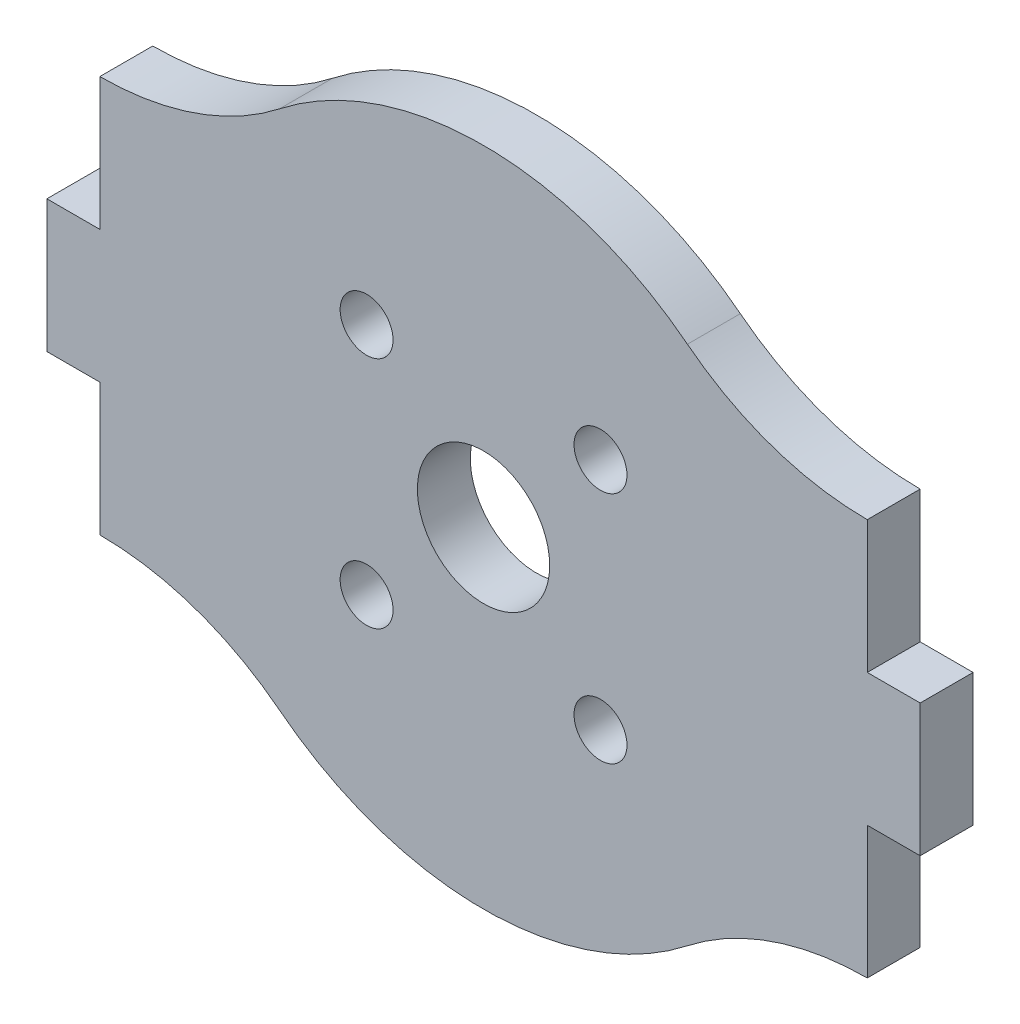
ISO-10303-21;
HEADER;
FILE_DESCRIPTION(('STEP AP214'),'2;1');
FILE_NAME('part.step','',(''),(''),'','','');
FILE_SCHEMA(('AUTOMOTIVE_DESIGN { 1 0 10303 214 1 1 1 1 }'));
ENDSEC;
DATA;
#1=APPLICATION_CONTEXT('core data for automotive mechanical design processes');
#2=APPLICATION_PROTOCOL_DEFINITION('international standard','automotive_design',2000,#1);
#3=PRODUCT_CONTEXT('',#1,'mechanical');
#4=PRODUCT('Part','Part','',(#3));
#5=PRODUCT_RELATED_PRODUCT_CATEGORY('part','',(#4));
#6=PRODUCT_DEFINITION_FORMATION('','',#4);
#7=PRODUCT_DEFINITION_CONTEXT('part definition',#1,'design');
#8=PRODUCT_DEFINITION('design','',#6,#7);
#9=PRODUCT_DEFINITION_SHAPE('','',#8);
#10=(LENGTH_UNIT() NAMED_UNIT(*) SI_UNIT(.MILLI.,.METRE.));
#11=(NAMED_UNIT(*) PLANE_ANGLE_UNIT() SI_UNIT($,.RADIAN.));
#12=(NAMED_UNIT(*) SI_UNIT($,.STERADIAN.) SOLID_ANGLE_UNIT());
#13=UNCERTAINTY_MEASURE_WITH_UNIT(LENGTH_MEASURE(1.E-05),#10,'distance_accuracy_value','');
#14=(GEOMETRIC_REPRESENTATION_CONTEXT(3) GLOBAL_UNCERTAINTY_ASSIGNED_CONTEXT((#13)) GLOBAL_UNIT_ASSIGNED_CONTEXT((#10,
#11,#12)) REPRESENTATION_CONTEXT('',''));
#15=CARTESIAN_POINT('',(0.,0.,0.));
#16=DIRECTION('',(0.,0.,1.));
#17=DIRECTION('',(1.,0.,0.));
#18=AXIS2_PLACEMENT_3D('',#15,#16,#17);
#19=CARTESIAN_POINT('',(29.,37.05,4.));
#20=DIRECTION('',(0.,0.,-1.));
#21=DIRECTION('',(-1.,0.,0.));
#22=AXIS2_PLACEMENT_3D('',#19,#20,#21);
#23=PLANE('',#22);
#24=DIRECTION('',(-1.,0.,0.));
#25=VECTOR('',#24,1.);
#26=CARTESIAN_POINT('',(33.,5.,4.));
#27=LINE('',#26,#25);
#28=CARTESIAN_POINT('',(33.,5.,4.));
#29=VERTEX_POINT('',#28);
#30=CARTESIAN_POINT('',(29.,5.,4.));
#31=VERTEX_POINT('',#30);
#32=EDGE_CURVE('E209',#29,#31,#27,.T.);
#33=ORIENTED_EDGE('',*,*,#32,.T.);
#34=DIRECTION('',(0.,1.,0.));
#35=VECTOR('',#34,1.);
#36=CARTESIAN_POINT('',(29.,5.,4.));
#37=LINE('',#36,#35);
#38=CARTESIAN_POINT('',(29.,15.,4.));
#39=VERTEX_POINT('',#38);
#40=EDGE_CURVE('E117',#31,#39,#37,.T.);
#41=ORIENTED_EDGE('',*,*,#40,.T.);
#42=CARTESIAN_POINT('',(29.,37.05,4.));
#43=DIRECTION('',(0.,0.,-1.));
#44=DIRECTION('',(-1.,0.,0.));
#45=AXIS2_PLACEMENT_3D('',#42,#43,#44);
#46=CIRCLE('',#45,22.05);
#47=CARTESIAN_POINT('',(15.4091392136026,19.6865037194474,4.));
#48=VERTEX_POINT('',#47);
#49=EDGE_CURVE('E248',#39,#48,#46,.T.);
#50=ORIENTED_EDGE('',*,*,#49,.T.);
#51=CARTESIAN_POINT('',(0.,0.,4.));
#52=DIRECTION('',(0.,0.,1.));
#53=DIRECTION('',(1.,0.,0.));
#54=AXIS2_PLACEMENT_3D('',#51,#52,#53);
#55=CIRCLE('',#54,25.);
#56=CARTESIAN_POINT('',(-15.4091392136026,19.6865037194474,4.));
#57=VERTEX_POINT('',#56);
#58=EDGE_CURVE('E267',#48,#57,#55,.T.);
#59=ORIENTED_EDGE('',*,*,#58,.T.);
#60=CARTESIAN_POINT('',(-29.,37.05,4.));
#61=DIRECTION('',(0.,0.,-1.));
#62=DIRECTION('',(1.,0.,0.));
#63=AXIS2_PLACEMENT_3D('',#60,#61,#62);
#64=CIRCLE('',#63,22.05);
#65=CARTESIAN_POINT('',(-29.,15.,4.));
#66=VERTEX_POINT('',#65);
#67=EDGE_CURVE('E264',#57,#66,#64,.T.);
#68=ORIENTED_EDGE('',*,*,#67,.T.);
#69=DIRECTION('',(0.,-1.,0.));
#70=VECTOR('',#69,1.);
#71=CARTESIAN_POINT('',(-29.,5.,4.));
#72=LINE('',#71,#70);
#73=CARTESIAN_POINT('',(-29.,5.,4.));
#74=VERTEX_POINT('',#73);
#75=EDGE_CURVE('E266',#66,#74,#72,.T.);
#76=ORIENTED_EDGE('',*,*,#75,.T.);
#77=DIRECTION('',(-1.,0.,0.));
#78=VECTOR('',#77,1.);
#79=CARTESIAN_POINT('',(-33.,5.,4.));
#80=LINE('',#79,#78);
#81=CARTESIAN_POINT('',(-33.,5.,4.));
#82=VERTEX_POINT('',#81);
#83=EDGE_CURVE('E269',#74,#82,#80,.T.);
#84=ORIENTED_EDGE('',*,*,#83,.T.);
#85=DIRECTION('',(0.,-1.,0.));
#86=VECTOR('',#85,1.);
#87=CARTESIAN_POINT('',(-33.,-5.,4.));
#88=LINE('',#87,#86);
#89=CARTESIAN_POINT('',(-33.,-5.,4.));
#90=VERTEX_POINT('',#89);
#91=EDGE_CURVE('E275',#82,#90,#88,.T.);
#92=ORIENTED_EDGE('',*,*,#91,.T.);
#93=DIRECTION('',(1.,0.,0.));
#94=VECTOR('',#93,1.);
#95=CARTESIAN_POINT('',(-33.,-5.,4.));
#96=LINE('',#95,#94);
#97=CARTESIAN_POINT('',(-29.,-5.,4.));
#98=VERTEX_POINT('',#97);
#99=EDGE_CURVE('E277',#90,#98,#96,.T.);
#100=ORIENTED_EDGE('',*,*,#99,.T.);
#101=DIRECTION('',(0.,-1.,0.));
#102=VECTOR('',#101,1.);
#103=CARTESIAN_POINT('',(-29.,-5.,4.));
#104=LINE('',#103,#102);
#105=CARTESIAN_POINT('',(-29.,-15.,4.));
#106=VERTEX_POINT('',#105);
#107=EDGE_CURVE('E279',#98,#106,#104,.T.);
#108=ORIENTED_EDGE('',*,*,#107,.T.);
#109=CARTESIAN_POINT('',(-29.,-37.05,4.));
#110=DIRECTION('',(0.,0.,-1.));
#111=DIRECTION('',(-1.,0.,0.));
#112=AXIS2_PLACEMENT_3D('',#109,#110,#111);
#113=CIRCLE('',#112,22.05);
#114=CARTESIAN_POINT('',(-15.4091392136026,-19.6865037194474,4.));
#115=VERTEX_POINT('',#114);
#116=EDGE_CURVE('E281',#106,#115,#113,.T.);
#117=ORIENTED_EDGE('',*,*,#116,.T.);
#118=CARTESIAN_POINT('',(0.,0.,4.));
#119=DIRECTION('',(0.,0.,1.));
#120=DIRECTION('',(-1.,0.,0.));
#121=AXIS2_PLACEMENT_3D('',#118,#119,#120);
#122=CIRCLE('',#121,25.);
#123=CARTESIAN_POINT('',(15.4091392136026,-19.6865037194474,4.));
#124=VERTEX_POINT('',#123);
#125=EDGE_CURVE('E283',#115,#124,#122,.T.);
#126=ORIENTED_EDGE('',*,*,#125,.T.);
#127=CARTESIAN_POINT('',(29.,-37.05,4.));
#128=DIRECTION('',(0.,0.,-1.));
#129=DIRECTION('',(1.,0.,0.));
#130=AXIS2_PLACEMENT_3D('',#127,#128,#129);
#131=CIRCLE('',#130,22.05);
#132=CARTESIAN_POINT('',(29.,-15.,4.));
#133=VERTEX_POINT('',#132);
#134=EDGE_CURVE('E160',#124,#133,#131,.T.);
#135=ORIENTED_EDGE('',*,*,#134,.T.);
#136=DIRECTION('',(0.,1.,0.));
#137=VECTOR('',#136,1.);
#138=CARTESIAN_POINT('',(29.,-5.,4.));
#139=LINE('',#138,#137);
#140=CARTESIAN_POINT('',(29.,-5.,4.));
#141=VERTEX_POINT('',#140);
#142=EDGE_CURVE('E154',#133,#141,#139,.T.);
#143=ORIENTED_EDGE('',*,*,#142,.T.);
#144=DIRECTION('',(1.,0.,0.));
#145=VECTOR('',#144,1.);
#146=CARTESIAN_POINT('',(33.,-5.,4.));
#147=LINE('',#146,#145);
#148=CARTESIAN_POINT('',(33.,-5.,4.));
#149=VERTEX_POINT('',#148);
#150=EDGE_CURVE('E158',#141,#149,#147,.T.);
#151=ORIENTED_EDGE('',*,*,#150,.T.);
#152=DIRECTION('',(0.,1.,0.));
#153=VECTOR('',#152,1.);
#154=CARTESIAN_POINT('',(33.,-5.,4.));
#155=LINE('',#154,#153);
#156=EDGE_CURVE('E50',#149,#29,#155,.T.);
#157=ORIENTED_EDGE('',*,*,#156,.T.);
#158=EDGE_LOOP('',(#33,#41,#50,#59,#68,#76,#84,#92,#100,#108,#117,#126,#135,#143,#151,#157));
#159=FACE_BOUND('',#158,.T.);
#160=CARTESIAN_POINT('',(0.,0.,4.));
#161=DIRECTION('',(0.,0.,1.));
#162=DIRECTION('',(1.,0.,0.));
#163=AXIS2_PLACEMENT_3D('',#160,#161,#162);
#164=CIRCLE('',#163,5.);
#165=CARTESIAN_POINT('',(5.,0.,4.));
#166=VERTEX_POINT('',#165);
#167=EDGE_CURVE('E182',#166,#166,#164,.T.);
#168=ORIENTED_EDGE('',*,*,#167,.F.);
#169=EDGE_LOOP('',(#168));
#170=FACE_BOUND('',#169,.T.);
#171=CARTESIAN_POINT('',(-8.83883476483182,8.83883476483183,4.));
#172=DIRECTION('',(0.,0.,1.));
#173=DIRECTION('',(1.,0.,0.));
#174=AXIS2_PLACEMENT_3D('',#171,#172,#173);
#175=CIRCLE('',#174,2.);
#176=CARTESIAN_POINT('',(-6.83883476483182,8.83883476483183,4.));
#177=VERTEX_POINT('',#176);
#178=EDGE_CURVE('E357',#177,#177,#175,.T.);
#179=ORIENTED_EDGE('',*,*,#178,.F.);
#180=EDGE_LOOP('',(#179));
#181=FACE_BOUND('',#180,.T.);
#182=CARTESIAN_POINT('',(8.83883476483187,8.83883476483183,4.));
#183=DIRECTION('',(0.,0.,1.));
#184=DIRECTION('',(1.,0.,0.));
#185=AXIS2_PLACEMENT_3D('',#182,#183,#184);
#186=CIRCLE('',#185,2.);
#187=CARTESIAN_POINT('',(10.8388347648319,8.83883476483183,4.));
#188=VERTEX_POINT('',#187);
#189=EDGE_CURVE('E351',#188,#188,#186,.T.);
#190=ORIENTED_EDGE('',*,*,#189,.F.);
#191=EDGE_LOOP('',(#190));
#192=FACE_BOUND('',#191,.T.);
#193=CARTESIAN_POINT('',(8.83883476483186,-8.83883476483186,4.));
#194=DIRECTION('',(0.,0.,1.));
#195=DIRECTION('',(1.,0.,0.));
#196=AXIS2_PLACEMENT_3D('',#193,#194,#195);
#197=CIRCLE('',#196,2.);
#198=CARTESIAN_POINT('',(10.8388347648319,-8.83883476483186,4.));
#199=VERTEX_POINT('',#198);
#200=EDGE_CURVE('E345',#199,#199,#197,.T.);
#201=ORIENTED_EDGE('',*,*,#200,.F.);
#202=EDGE_LOOP('',(#201));
#203=FACE_BOUND('',#202,.T.);
#204=CARTESIAN_POINT('',(-8.83883476483182,-8.83883476483186,4.));
#205=DIRECTION('',(0.,0.,1.));
#206=DIRECTION('',(1.,0.,0.));
#207=AXIS2_PLACEMENT_3D('',#204,#205,#206);
#208=CIRCLE('',#207,2.);
#209=CARTESIAN_POINT('',(-6.83883476483182,-8.83883476483186,4.));
#210=VERTEX_POINT('',#209);
#211=EDGE_CURVE('E336',#210,#210,#208,.T.);
#212=ORIENTED_EDGE('',*,*,#211,.F.);
#213=EDGE_LOOP('',(#212));
#214=FACE_BOUND('',#213,.T.);
#215=ADVANCED_FACE('F33',(#159,#170,#181,#192,#203,#214),#23,.F.);
#216=CARTESIAN_POINT('',(29.,37.05,0.));
#217=DIRECTION('',(0.,0.,-1.));
#218=DIRECTION('',(-1.,0.,0.));
#219=AXIS2_PLACEMENT_3D('',#216,#217,#218);
#220=PLANE('',#219);
#221=CARTESIAN_POINT('',(8.83883476483186,-8.83883476483186,0.));
#222=DIRECTION('',(0.,0.,1.));
#223=DIRECTION('',(1.,0.,0.));
#224=AXIS2_PLACEMENT_3D('',#221,#222,#223);
#225=CIRCLE('',#224,2.);
#226=CARTESIAN_POINT('',(10.8388347648319,-8.83883476483186,0.));
#227=VERTEX_POINT('',#226);
#228=EDGE_CURVE('E342',#227,#227,#225,.T.);
#229=ORIENTED_EDGE('',*,*,#228,.T.);
#230=EDGE_LOOP('',(#229));
#231=FACE_BOUND('',#230,.T.);
#232=CARTESIAN_POINT('',(-8.83883476483182,8.83883476483183,0.));
#233=DIRECTION('',(0.,0.,1.));
#234=DIRECTION('',(1.,0.,0.));
#235=AXIS2_PLACEMENT_3D('',#232,#233,#234);
#236=CIRCLE('',#235,2.);
#237=CARTESIAN_POINT('',(-6.83883476483182,8.83883476483183,0.));
#238=VERTEX_POINT('',#237);
#239=EDGE_CURVE('E354',#238,#238,#236,.T.);
#240=ORIENTED_EDGE('',*,*,#239,.T.);
#241=EDGE_LOOP('',(#240));
#242=FACE_BOUND('',#241,.T.);
#243=DIRECTION('',(-1.,0.,0.));
#244=VECTOR('',#243,1.);
#245=CARTESIAN_POINT('',(33.,5.,0.));
#246=LINE('',#245,#244);
#247=CARTESIAN_POINT('',(33.,5.,0.));
#248=VERTEX_POINT('',#247);
#249=CARTESIAN_POINT('',(29.,5.,0.));
#250=VERTEX_POINT('',#249);
#251=EDGE_CURVE('E178',#248,#250,#246,.T.);
#252=ORIENTED_EDGE('',*,*,#251,.F.);
#253=DIRECTION('',(0.,1.,0.));
#254=VECTOR('',#253,1.);
#255=CARTESIAN_POINT('',(33.,-5.,0.));
#256=LINE('',#255,#254);
#257=CARTESIAN_POINT('',(33.,-5.,0.));
#258=VERTEX_POINT('',#257);
#259=EDGE_CURVE('E109',#258,#248,#256,.T.);
#260=ORIENTED_EDGE('',*,*,#259,.F.);
#261=DIRECTION('',(1.,0.,0.));
#262=VECTOR('',#261,1.);
#263=CARTESIAN_POINT('',(33.,-5.,0.));
#264=LINE('',#263,#262);
#265=CARTESIAN_POINT('',(29.,-5.,0.));
#266=VERTEX_POINT('',#265);
#267=EDGE_CURVE('E103',#266,#258,#264,.T.);
#268=ORIENTED_EDGE('',*,*,#267,.F.);
#269=DIRECTION('',(0.,1.,0.));
#270=VECTOR('',#269,1.);
#271=CARTESIAN_POINT('',(29.,-5.,0.));
#272=LINE('',#271,#270);
#273=CARTESIAN_POINT('',(29.,-15.,0.));
#274=VERTEX_POINT('',#273);
#275=EDGE_CURVE('E168',#274,#266,#272,.T.);
#276=ORIENTED_EDGE('',*,*,#275,.F.);
#277=CARTESIAN_POINT('',(29.,-37.05,0.));
#278=DIRECTION('',(0.,0.,-1.));
#279=DIRECTION('',(1.,0.,0.));
#280=AXIS2_PLACEMENT_3D('',#277,#278,#279);
#281=CIRCLE('',#280,22.05);
#282=CARTESIAN_POINT('',(15.4091392136026,-19.6865037194474,0.));
#283=VERTEX_POINT('',#282);
#284=EDGE_CURVE('E204',#283,#274,#281,.T.);
#285=ORIENTED_EDGE('',*,*,#284,.F.);
#286=CARTESIAN_POINT('',(0.,0.,0.));
#287=DIRECTION('',(0.,0.,1.));
#288=DIRECTION('',(-1.,0.,0.));
#289=AXIS2_PLACEMENT_3D('',#286,#287,#288);
#290=CIRCLE('',#289,25.);
#291=CARTESIAN_POINT('',(-15.4091392136026,-19.6865037194474,0.));
#292=VERTEX_POINT('',#291);
#293=EDGE_CURVE('E202',#292,#283,#290,.T.);
#294=ORIENTED_EDGE('',*,*,#293,.F.);
#295=CARTESIAN_POINT('',(-29.,-37.05,0.));
#296=DIRECTION('',(0.,0.,-1.));
#297=DIRECTION('',(-1.,0.,0.));
#298=AXIS2_PLACEMENT_3D('',#295,#296,#297);
#299=CIRCLE('',#298,22.05);
#300=CARTESIAN_POINT('',(-29.,-15.,0.));
#301=VERTEX_POINT('',#300);
#302=EDGE_CURVE('E200',#301,#292,#299,.T.);
#303=ORIENTED_EDGE('',*,*,#302,.F.);
#304=DIRECTION('',(0.,-1.,0.));
#305=VECTOR('',#304,1.);
#306=CARTESIAN_POINT('',(-29.,-5.,0.));
#307=LINE('',#306,#305);
#308=CARTESIAN_POINT('',(-29.,-5.,0.));
#309=VERTEX_POINT('',#308);
#310=EDGE_CURVE('E198',#309,#301,#307,.T.);
#311=ORIENTED_EDGE('',*,*,#310,.F.);
#312=DIRECTION('',(1.,0.,0.));
#313=VECTOR('',#312,1.);
#314=CARTESIAN_POINT('',(-33.,-5.,0.));
#315=LINE('',#314,#313);
#316=CARTESIAN_POINT('',(-33.,-5.,0.));
#317=VERTEX_POINT('',#316);
#318=EDGE_CURVE('E196',#317,#309,#315,.T.);
#319=ORIENTED_EDGE('',*,*,#318,.F.);
#320=DIRECTION('',(0.,-1.,0.));
#321=VECTOR('',#320,1.);
#322=CARTESIAN_POINT('',(-33.,-5.,0.));
#323=LINE('',#322,#321);
#324=CARTESIAN_POINT('',(-33.,5.,0.));
#325=VERTEX_POINT('',#324);
#326=EDGE_CURVE('E194',#325,#317,#323,.T.);
#327=ORIENTED_EDGE('',*,*,#326,.F.);
#328=DIRECTION('',(-1.,0.,0.));
#329=VECTOR('',#328,1.);
#330=CARTESIAN_POINT('',(-33.,5.,0.));
#331=LINE('',#330,#329);
#332=CARTESIAN_POINT('',(-29.,5.,0.));
#333=VERTEX_POINT('',#332);
#334=EDGE_CURVE('E192',#333,#325,#331,.T.);
#335=ORIENTED_EDGE('',*,*,#334,.F.);
#336=DIRECTION('',(0.,-1.,0.));
#337=VECTOR('',#336,1.);
#338=CARTESIAN_POINT('',(-29.,5.,0.));
#339=LINE('',#338,#337);
#340=CARTESIAN_POINT('',(-29.,15.,0.));
#341=VERTEX_POINT('',#340);
#342=EDGE_CURVE('E190',#341,#333,#339,.T.);
#343=ORIENTED_EDGE('',*,*,#342,.F.);
#344=CARTESIAN_POINT('',(-29.,37.05,0.));
#345=DIRECTION('',(0.,0.,-1.));
#346=DIRECTION('',(1.,0.,0.));
#347=AXIS2_PLACEMENT_3D('',#344,#345,#346);
#348=CIRCLE('',#347,22.05);
#349=CARTESIAN_POINT('',(-15.4091392136026,19.6865037194474,0.));
#350=VERTEX_POINT('',#349);
#351=EDGE_CURVE('E188',#350,#341,#348,.T.);
#352=ORIENTED_EDGE('',*,*,#351,.F.);
#353=CARTESIAN_POINT('',(0.,0.,0.));
#354=DIRECTION('',(0.,0.,1.));
#355=DIRECTION('',(1.,0.,0.));
#356=AXIS2_PLACEMENT_3D('',#353,#354,#355);
#357=CIRCLE('',#356,25.);
#358=CARTESIAN_POINT('',(15.4091392136026,19.6865037194474,0.));
#359=VERTEX_POINT('',#358);
#360=EDGE_CURVE('E186',#359,#350,#357,.T.);
#361=ORIENTED_EDGE('',*,*,#360,.F.);
#362=CARTESIAN_POINT('',(29.,37.05,0.));
#363=DIRECTION('',(0.,0.,-1.));
#364=DIRECTION('',(-1.,0.,0.));
#365=AXIS2_PLACEMENT_3D('',#362,#363,#364);
#366=CIRCLE('',#365,22.05);
#367=CARTESIAN_POINT('',(29.,15.,0.));
#368=VERTEX_POINT('',#367);
#369=EDGE_CURVE('E184',#368,#359,#366,.T.);
#370=ORIENTED_EDGE('',*,*,#369,.F.);
#371=DIRECTION('',(0.,1.,0.));
#372=VECTOR('',#371,1.);
#373=CARTESIAN_POINT('',(29.,5.,0.));
#374=LINE('',#373,#372);
#375=EDGE_CURVE('E181',#250,#368,#374,.T.);
#376=ORIENTED_EDGE('',*,*,#375,.F.);
#377=EDGE_LOOP('',(#252,#260,#268,#276,#285,#294,#303,#311,#319,#327,#335,#343,#352,#361,#370,#376));
#378=FACE_BOUND('',#377,.T.);
#379=CARTESIAN_POINT('',(0.,0.,0.));
#380=DIRECTION('',(0.,0.,1.));
#381=DIRECTION('',(1.,0.,0.));
#382=AXIS2_PLACEMENT_3D('',#379,#380,#381);
#383=CIRCLE('',#382,5.);
#384=CARTESIAN_POINT('',(5.,0.,0.));
#385=VERTEX_POINT('',#384);
#386=EDGE_CURVE('E360',#385,#385,#383,.T.);
#387=ORIENTED_EDGE('',*,*,#386,.T.);
#388=EDGE_LOOP('',(#387));
#389=FACE_BOUND('',#388,.T.);
#390=CARTESIAN_POINT('',(8.83883476483187,8.83883476483183,0.));
#391=DIRECTION('',(0.,0.,1.));
#392=DIRECTION('',(1.,0.,0.));
#393=AXIS2_PLACEMENT_3D('',#390,#391,#392);
#394=CIRCLE('',#393,2.);
#395=CARTESIAN_POINT('',(10.8388347648319,8.83883476483183,0.));
#396=VERTEX_POINT('',#395);
#397=EDGE_CURVE('E348',#396,#396,#394,.T.);
#398=ORIENTED_EDGE('',*,*,#397,.T.);
#399=EDGE_LOOP('',(#398));
#400=FACE_BOUND('',#399,.T.);
#401=CARTESIAN_POINT('',(-8.83883476483182,-8.83883476483186,0.));
#402=DIRECTION('',(0.,0.,1.));
#403=DIRECTION('',(1.,0.,0.));
#404=AXIS2_PLACEMENT_3D('',#401,#402,#403);
#405=CIRCLE('',#404,2.);
#406=CARTESIAN_POINT('',(-6.83883476483182,-8.83883476483186,0.));
#407=VERTEX_POINT('',#406);
#408=EDGE_CURVE('E339',#407,#407,#405,.T.);
#409=ORIENTED_EDGE('',*,*,#408,.T.);
#410=EDGE_LOOP('',(#409));
#411=FACE_BOUND('',#410,.T.);
#412=ADVANCED_FACE('F252',(#231,#242,#378,#389,#400,#411),#220,.T.);
#413=CARTESIAN_POINT('',(33.,5.,4.));
#414=DIRECTION('',(0.,-1.,0.));
#415=DIRECTION('',(1.,0.,0.));
#416=AXIS2_PLACEMENT_3D('',#413,#414,#415);
#417=PLANE('',#416);
#418=ORIENTED_EDGE('',*,*,#251,.T.);
#419=DIRECTION('',(0.,0.,-1.));
#420=VECTOR('',#419,1.);
#421=CARTESIAN_POINT('',(29.,5.,4.));
#422=LINE('',#421,#420);
#423=EDGE_CURVE('E11',#31,#250,#422,.T.);
#424=ORIENTED_EDGE('',*,*,#423,.F.);
#425=ORIENTED_EDGE('',*,*,#32,.F.);
#426=DIRECTION('',(0.,0.,-1.));
#427=VECTOR('',#426,1.);
#428=CARTESIAN_POINT('',(33.,5.,4.));
#429=LINE('',#428,#427);
#430=EDGE_CURVE('E174',#29,#248,#429,.T.);
#431=ORIENTED_EDGE('',*,*,#430,.T.);
#432=EDGE_LOOP('',(#418,#424,#425,#431));
#433=FACE_BOUND('',#432,.T.);
#434=ADVANCED_FACE('F35',(#433),#417,.F.);
#435=CARTESIAN_POINT('',(29.,5.,4.));
#436=DIRECTION('',(-1.,0.,0.));
#437=DIRECTION('',(0.,0.,1.));
#438=AXIS2_PLACEMENT_3D('',#435,#436,#437);
#439=PLANE('',#438);
#440=ORIENTED_EDGE('',*,*,#375,.T.);
#441=DIRECTION('',(0.,0.,-1.));
#442=VECTOR('',#441,1.);
#443=CARTESIAN_POINT('',(29.,15.,4.));
#444=LINE('',#443,#442);
#445=EDGE_CURVE('E42',#39,#368,#444,.T.);
#446=ORIENTED_EDGE('',*,*,#445,.F.);
#447=ORIENTED_EDGE('',*,*,#40,.F.);
#448=ORIENTED_EDGE('',*,*,#423,.T.);
#449=EDGE_LOOP('',(#440,#446,#447,#448));
#450=FACE_BOUND('',#449,.T.);
#451=ADVANCED_FACE('F521',(#450),#439,.F.);
#452=CARTESIAN_POINT('',(29.,37.05,4.));
#453=DIRECTION('',(0.,0.,-1.));
#454=DIRECTION('',(-1.,0.,0.));
#455=AXIS2_PLACEMENT_3D('',#452,#453,#454);
#456=CYLINDRICAL_SURFACE('',#455,22.05);
#457=ORIENTED_EDGE('',*,*,#369,.T.);
#458=DIRECTION('',(0.,0.,-1.));
#459=VECTOR('',#458,1.);
#460=CARTESIAN_POINT('',(15.4091392136026,19.6865037194474,4.));
#461=LINE('',#460,#459);
#462=EDGE_CURVE('E240',#48,#359,#461,.T.);
#463=ORIENTED_EDGE('',*,*,#462,.F.);
#464=ORIENTED_EDGE('',*,*,#49,.F.);
#465=ORIENTED_EDGE('',*,*,#445,.T.);
#466=EDGE_LOOP('',(#457,#463,#464,#465));
#467=FACE_BOUND('',#466,.T.);
#468=ADVANCED_FACE('F246',(#467),#456,.F.);
#469=CARTESIAN_POINT('',(0.,0.,4.));
#470=DIRECTION('',(0.,0.,-1.));
#471=DIRECTION('',(-1.,0.,0.));
#472=AXIS2_PLACEMENT_3D('',#469,#470,#471);
#473=CYLINDRICAL_SURFACE('',#472,25.);
#474=ORIENTED_EDGE('',*,*,#360,.T.);
#475=DIRECTION('',(0.,0.,-1.));
#476=VECTOR('',#475,1.);
#477=CARTESIAN_POINT('',(-15.4091392136026,19.6865037194474,4.));
#478=LINE('',#477,#476);
#479=EDGE_CURVE('E237',#57,#350,#478,.T.);
#480=ORIENTED_EDGE('',*,*,#479,.F.);
#481=ORIENTED_EDGE('',*,*,#58,.F.);
#482=ORIENTED_EDGE('',*,*,#462,.T.);
#483=EDGE_LOOP('',(#474,#480,#481,#482));
#484=FACE_BOUND('',#483,.T.);
#485=ADVANCED_FACE('F258',(#484),#473,.T.);
#486=CARTESIAN_POINT('',(-29.,37.05,4.));
#487=DIRECTION('',(0.,0.,-1.));
#488=DIRECTION('',(-1.,0.,0.));
#489=AXIS2_PLACEMENT_3D('',#486,#487,#488);
#490=CYLINDRICAL_SURFACE('',#489,22.05);
#491=ORIENTED_EDGE('',*,*,#351,.T.);
#492=DIRECTION('',(0.,0.,-1.));
#493=VECTOR('',#492,1.);
#494=CARTESIAN_POINT('',(-29.,15.,4.));
#495=LINE('',#494,#493);
#496=EDGE_CURVE('E234',#66,#341,#495,.T.);
#497=ORIENTED_EDGE('',*,*,#496,.F.);
#498=ORIENTED_EDGE('',*,*,#67,.F.);
#499=ORIENTED_EDGE('',*,*,#479,.T.);
#500=EDGE_LOOP('',(#491,#497,#498,#499));
#501=FACE_BOUND('',#500,.T.);
#502=ADVANCED_FACE('F262',(#501),#490,.F.);
#503=CARTESIAN_POINT('',(-29.,5.,4.));
#504=DIRECTION('',(1.,0.,0.));
#505=DIRECTION('',(0.,0.,-1.));
#506=AXIS2_PLACEMENT_3D('',#503,#504,#505);
#507=PLANE('',#506);
#508=ORIENTED_EDGE('',*,*,#342,.T.);
#509=DIRECTION('',(0.,0.,-1.));
#510=VECTOR('',#509,1.);
#511=CARTESIAN_POINT('',(-29.,5.,4.));
#512=LINE('',#511,#510);
#513=EDGE_CURVE('E231',#74,#333,#512,.T.);
#514=ORIENTED_EDGE('',*,*,#513,.F.);
#515=ORIENTED_EDGE('',*,*,#75,.F.);
#516=ORIENTED_EDGE('',*,*,#496,.T.);
#517=EDGE_LOOP('',(#508,#514,#515,#516));
#518=FACE_BOUND('',#517,.T.);
#519=ADVANCED_FACE('F486',(#518),#507,.F.);
#520=CARTESIAN_POINT('',(-33.,5.,4.));
#521=DIRECTION('',(0.,-1.,0.));
#522=DIRECTION('',(1.,0.,0.));
#523=AXIS2_PLACEMENT_3D('',#520,#521,#522);
#524=PLANE('',#523);
#525=ORIENTED_EDGE('',*,*,#334,.T.);
#526=DIRECTION('',(0.,0.,-1.));
#527=VECTOR('',#526,1.);
#528=CARTESIAN_POINT('',(-33.,5.,4.));
#529=LINE('',#528,#527);
#530=EDGE_CURVE('E228',#82,#325,#529,.T.);
#531=ORIENTED_EDGE('',*,*,#530,.F.);
#532=ORIENTED_EDGE('',*,*,#83,.F.);
#533=ORIENTED_EDGE('',*,*,#513,.T.);
#534=EDGE_LOOP('',(#525,#531,#532,#533));
#535=FACE_BOUND('',#534,.T.);
#536=ADVANCED_FACE('F476',(#535),#524,.F.);
#537=CARTESIAN_POINT('',(-33.,-5.,4.));
#538=DIRECTION('',(1.,0.,0.));
#539=DIRECTION('',(0.,0.,-1.));
#540=AXIS2_PLACEMENT_3D('',#537,#538,#539);
#541=PLANE('',#540);
#542=ORIENTED_EDGE('',*,*,#326,.T.);
#543=DIRECTION('',(0.,0.,-1.));
#544=VECTOR('',#543,1.);
#545=CARTESIAN_POINT('',(-33.,-5.,4.));
#546=LINE('',#545,#544);
#547=EDGE_CURVE('E225',#90,#317,#546,.T.);
#548=ORIENTED_EDGE('',*,*,#547,.F.);
#549=ORIENTED_EDGE('',*,*,#91,.F.);
#550=ORIENTED_EDGE('',*,*,#530,.T.);
#551=EDGE_LOOP('',(#542,#548,#549,#550));
#552=FACE_BOUND('',#551,.T.);
#553=ADVANCED_FACE('F466',(#552),#541,.F.);
#554=CARTESIAN_POINT('',(-33.,-5.,4.));
#555=DIRECTION('',(0.,1.,0.));
#556=DIRECTION('',(-1.,0.,0.));
#557=AXIS2_PLACEMENT_3D('',#554,#555,#556);
#558=PLANE('',#557);
#559=ORIENTED_EDGE('',*,*,#318,.T.);
#560=DIRECTION('',(0.,0.,-1.));
#561=VECTOR('',#560,1.);
#562=CARTESIAN_POINT('',(-29.,-5.,4.));
#563=LINE('',#562,#561);
#564=EDGE_CURVE('E222',#98,#309,#563,.T.);
#565=ORIENTED_EDGE('',*,*,#564,.F.);
#566=ORIENTED_EDGE('',*,*,#99,.F.);
#567=ORIENTED_EDGE('',*,*,#547,.T.);
#568=EDGE_LOOP('',(#559,#565,#566,#567));
#569=FACE_BOUND('',#568,.T.);
#570=ADVANCED_FACE('F456',(#569),#558,.F.);
#571=CARTESIAN_POINT('',(-29.,-5.,4.));
#572=DIRECTION('',(1.,0.,0.));
#573=DIRECTION('',(0.,0.,-1.));
#574=AXIS2_PLACEMENT_3D('',#571,#572,#573);
#575=PLANE('',#574);
#576=ORIENTED_EDGE('',*,*,#310,.T.);
#577=DIRECTION('',(0.,0.,-1.));
#578=VECTOR('',#577,1.);
#579=CARTESIAN_POINT('',(-29.,-15.,4.));
#580=LINE('',#579,#578);
#581=EDGE_CURVE('E219',#106,#301,#580,.T.);
#582=ORIENTED_EDGE('',*,*,#581,.F.);
#583=ORIENTED_EDGE('',*,*,#107,.F.);
#584=ORIENTED_EDGE('',*,*,#564,.T.);
#585=EDGE_LOOP('',(#576,#582,#583,#584));
#586=FACE_BOUND('',#585,.T.);
#587=ADVANCED_FACE('F446',(#586),#575,.F.);
#588=CARTESIAN_POINT('',(-29.,-37.05,4.));
#589=DIRECTION('',(0.,0.,-1.));
#590=DIRECTION('',(-1.,0.,0.));
#591=AXIS2_PLACEMENT_3D('',#588,#589,#590);
#592=CYLINDRICAL_SURFACE('',#591,22.05);
#593=ORIENTED_EDGE('',*,*,#302,.T.);
#594=DIRECTION('',(0.,0.,-1.));
#595=VECTOR('',#594,1.);
#596=CARTESIAN_POINT('',(-15.4091392136026,-19.6865037194474,4.));
#597=LINE('',#596,#595);
#598=EDGE_CURVE('E216',#115,#292,#597,.T.);
#599=ORIENTED_EDGE('',*,*,#598,.F.);
#600=ORIENTED_EDGE('',*,*,#116,.F.);
#601=ORIENTED_EDGE('',*,*,#581,.T.);
#602=EDGE_LOOP('',(#593,#599,#600,#601));
#603=FACE_BOUND('',#602,.T.);
#604=ADVANCED_FACE('F437',(#603),#592,.F.);
#605=CARTESIAN_POINT('',(0.,0.,4.));
#606=DIRECTION('',(0.,0.,-1.));
#607=DIRECTION('',(-1.,0.,0.));
#608=AXIS2_PLACEMENT_3D('',#605,#606,#607);
#609=CYLINDRICAL_SURFACE('',#608,25.);
#610=ORIENTED_EDGE('',*,*,#293,.T.);
#611=DIRECTION('',(0.,0.,-1.));
#612=VECTOR('',#611,1.);
#613=CARTESIAN_POINT('',(15.4091392136026,-19.6865037194474,4.));
#614=LINE('',#613,#612);
#615=EDGE_CURVE('E213',#124,#283,#614,.T.);
#616=ORIENTED_EDGE('',*,*,#615,.F.);
#617=ORIENTED_EDGE('',*,*,#125,.F.);
#618=ORIENTED_EDGE('',*,*,#598,.T.);
#619=EDGE_LOOP('',(#610,#616,#617,#618));
#620=FACE_BOUND('',#619,.T.);
#621=ADVANCED_FACE('F289',(#620),#609,.T.);
#622=CARTESIAN_POINT('',(29.,-37.05,4.));
#623=DIRECTION('',(0.,0.,-1.));
#624=DIRECTION('',(-1.,0.,0.));
#625=AXIS2_PLACEMENT_3D('',#622,#623,#624);
#626=CYLINDRICAL_SURFACE('',#625,22.05);
#627=ORIENTED_EDGE('',*,*,#284,.T.);
#628=DIRECTION('',(0.,0.,-1.));
#629=VECTOR('',#628,1.);
#630=CARTESIAN_POINT('',(29.,-15.,4.));
#631=LINE('',#630,#629);
#632=EDGE_CURVE('E169',#133,#274,#631,.T.);
#633=ORIENTED_EDGE('',*,*,#632,.F.);
#634=ORIENTED_EDGE('',*,*,#134,.F.);
#635=ORIENTED_EDGE('',*,*,#615,.T.);
#636=EDGE_LOOP('',(#627,#633,#634,#635));
#637=FACE_BOUND('',#636,.T.);
#638=ADVANCED_FACE('F293',(#637),#626,.F.);
#639=CARTESIAN_POINT('',(29.,-5.,4.));
#640=DIRECTION('',(-1.,0.,0.));
#641=DIRECTION('',(0.,0.,1.));
#642=AXIS2_PLACEMENT_3D('',#639,#640,#641);
#643=PLANE('',#642);
#644=ORIENTED_EDGE('',*,*,#275,.T.);
#645=DIRECTION('',(0.,0.,-1.));
#646=VECTOR('',#645,1.);
#647=CARTESIAN_POINT('',(29.,-5.,4.));
#648=LINE('',#647,#646);
#649=EDGE_CURVE('E165',#141,#266,#648,.T.);
#650=ORIENTED_EDGE('',*,*,#649,.F.);
#651=ORIENTED_EDGE('',*,*,#142,.F.);
#652=ORIENTED_EDGE('',*,*,#632,.T.);
#653=EDGE_LOOP('',(#644,#650,#651,#652));
#654=FACE_BOUND('',#653,.T.);
#655=ADVANCED_FACE('F166',(#654),#643,.F.);
#656=CARTESIAN_POINT('',(33.,-5.,4.));
#657=DIRECTION('',(0.,1.,0.));
#658=DIRECTION('',(-1.,0.,0.));
#659=AXIS2_PLACEMENT_3D('',#656,#657,#658);
#660=PLANE('',#659);
#661=ORIENTED_EDGE('',*,*,#267,.T.);
#662=DIRECTION('',(0.,0.,-1.));
#663=VECTOR('',#662,1.);
#664=CARTESIAN_POINT('',(33.,-5.,4.));
#665=LINE('',#664,#663);
#666=EDGE_CURVE('E170',#149,#258,#665,.T.);
#667=ORIENTED_EDGE('',*,*,#666,.F.);
#668=ORIENTED_EDGE('',*,*,#150,.F.);
#669=ORIENTED_EDGE('',*,*,#649,.T.);
#670=EDGE_LOOP('',(#661,#667,#668,#669));
#671=FACE_BOUND('',#670,.T.);
#672=ADVANCED_FACE('F172',(#671),#660,.F.);
#673=CARTESIAN_POINT('',(33.,-5.,4.));
#674=DIRECTION('',(-1.,0.,0.));
#675=DIRECTION('',(0.,0.,1.));
#676=AXIS2_PLACEMENT_3D('',#673,#674,#675);
#677=PLANE('',#676);
#678=ORIENTED_EDGE('',*,*,#259,.T.);
#679=ORIENTED_EDGE('',*,*,#430,.F.);
#680=ORIENTED_EDGE('',*,*,#156,.F.);
#681=ORIENTED_EDGE('',*,*,#666,.T.);
#682=EDGE_LOOP('',(#678,#679,#680,#681));
#683=FACE_BOUND('',#682,.T.);
#684=ADVANCED_FACE('F297',(#683),#677,.F.);
#685=CARTESIAN_POINT('',(0.,0.,4.));
#686=DIRECTION('',(0.,0.,-1.));
#687=DIRECTION('',(-1.,0.,0.));
#688=AXIS2_PLACEMENT_3D('',#685,#686,#687);
#689=CYLINDRICAL_SURFACE('',#688,5.);
#690=ORIENTED_EDGE('',*,*,#167,.T.);
#691=EDGE_LOOP('',(#690));
#692=FACE_BOUND('',#691,.T.);
#693=ORIENTED_EDGE('',*,*,#386,.F.);
#694=EDGE_LOOP('',(#693));
#695=FACE_BOUND('',#694,.T.);
#696=ADVANCED_FACE('F299',(#692,#695),#689,.F.);
#697=CARTESIAN_POINT('',(-8.83883476483182,8.83883476483183,4.));
#698=DIRECTION('',(0.,0.,-1.));
#699=DIRECTION('',(-1.,0.,0.));
#700=AXIS2_PLACEMENT_3D('',#697,#698,#699);
#701=CYLINDRICAL_SURFACE('',#700,2.);
#702=ORIENTED_EDGE('',*,*,#178,.T.);
#703=EDGE_LOOP('',(#702));
#704=FACE_BOUND('',#703,.T.);
#705=ORIENTED_EDGE('',*,*,#239,.F.);
#706=EDGE_LOOP('',(#705));
#707=FACE_BOUND('',#706,.T.);
#708=ADVANCED_FACE('F305',(#704,#707),#701,.F.);
#709=CARTESIAN_POINT('',(8.83883476483187,8.83883476483183,4.));
#710=DIRECTION('',(0.,0.,-1.));
#711=DIRECTION('',(-1.,0.,0.));
#712=AXIS2_PLACEMENT_3D('',#709,#710,#711);
#713=CYLINDRICAL_SURFACE('',#712,2.);
#714=ORIENTED_EDGE('',*,*,#189,.T.);
#715=EDGE_LOOP('',(#714));
#716=FACE_BOUND('',#715,.T.);
#717=ORIENTED_EDGE('',*,*,#397,.F.);
#718=EDGE_LOOP('',(#717));
#719=FACE_BOUND('',#718,.T.);
#720=ADVANCED_FACE('F319',(#716,#719),#713,.F.);
#721=CARTESIAN_POINT('',(8.83883476483186,-8.83883476483186,4.));
#722=DIRECTION('',(0.,0.,-1.));
#723=DIRECTION('',(-1.,0.,0.));
#724=AXIS2_PLACEMENT_3D('',#721,#722,#723);
#725=CYLINDRICAL_SURFACE('',#724,2.);
#726=ORIENTED_EDGE('',*,*,#200,.T.);
#727=EDGE_LOOP('',(#726));
#728=FACE_BOUND('',#727,.T.);
#729=ORIENTED_EDGE('',*,*,#228,.F.);
#730=EDGE_LOOP('',(#729));
#731=FACE_BOUND('',#730,.T.);
#732=ADVANCED_FACE('F323',(#728,#731),#725,.F.);
#733=CARTESIAN_POINT('',(-8.83883476483182,-8.83883476483186,4.));
#734=DIRECTION('',(0.,0.,-1.));
#735=DIRECTION('',(-1.,0.,0.));
#736=AXIS2_PLACEMENT_3D('',#733,#734,#735);
#737=CYLINDRICAL_SURFACE('',#736,2.);
#738=ORIENTED_EDGE('',*,*,#211,.T.);
#739=EDGE_LOOP('',(#738));
#740=FACE_BOUND('',#739,.T.);
#741=ORIENTED_EDGE('',*,*,#408,.F.);
#742=EDGE_LOOP('',(#741));
#743=FACE_BOUND('',#742,.T.);
#744=ADVANCED_FACE('F327',(#740,#743),#737,.F.);
#745=CLOSED_SHELL('',(#215,#412,#434,#451,#468,#485,#502,#519,#536,#553,#570,#587,#604,#621,
#638,#655,#672,#684,#696,#708,#720,#732,#744));
#746=MANIFOLD_SOLID_BREP('B2',#745);
#747=ADVANCED_BREP_SHAPE_REPRESENTATION('',(#18,#746),#14);
#748=SHAPE_DEFINITION_REPRESENTATION(#9,#747);
ENDSEC;
END-ISO-10303-21;
